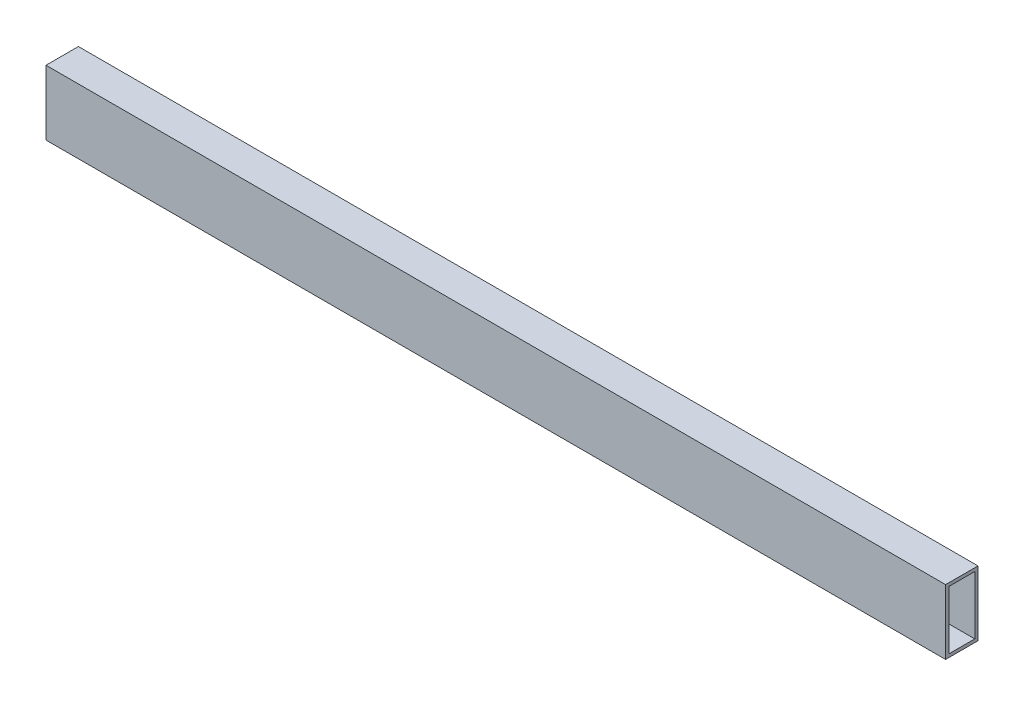
ISO-10303-21;
HEADER;
FILE_DESCRIPTION(('STEP AP214'),'2;1');
FILE_NAME('part.step','',(''),(''),'','','');
FILE_SCHEMA(('AUTOMOTIVE_DESIGN { 1 0 10303 214 1 1 1 1 }'));
ENDSEC;
DATA;
#1=APPLICATION_CONTEXT('core data for automotive mechanical design processes');
#2=APPLICATION_PROTOCOL_DEFINITION('international standard','automotive_design',2000,#1);
#3=PRODUCT_CONTEXT('',#1,'mechanical');
#4=PRODUCT('Part','Part','',(#3));
#5=PRODUCT_RELATED_PRODUCT_CATEGORY('part','',(#4));
#6=PRODUCT_DEFINITION_FORMATION('','',#4);
#7=PRODUCT_DEFINITION_CONTEXT('part definition',#1,'design');
#8=PRODUCT_DEFINITION('design','',#6,#7);
#9=PRODUCT_DEFINITION_SHAPE('','',#8);
#10=(LENGTH_UNIT() NAMED_UNIT(*) SI_UNIT(.MILLI.,.METRE.));
#11=(NAMED_UNIT(*) PLANE_ANGLE_UNIT() SI_UNIT($,.RADIAN.));
#12=(NAMED_UNIT(*) SI_UNIT($,.STERADIAN.) SOLID_ANGLE_UNIT());
#13=UNCERTAINTY_MEASURE_WITH_UNIT(LENGTH_MEASURE(1.E-05),#10,'distance_accuracy_value','');
#14=(GEOMETRIC_REPRESENTATION_CONTEXT(3) GLOBAL_UNCERTAINTY_ASSIGNED_CONTEXT((#13)) GLOBAL_UNIT_ASSIGNED_CONTEXT((#10,
#11,#12)) REPRESENTATION_CONTEXT('',''));
#15=CARTESIAN_POINT('',(0.,0.,0.));
#16=DIRECTION('',(0.,0.,1.));
#17=DIRECTION('',(1.,0.,0.));
#18=AXIS2_PLACEMENT_3D('',#15,#16,#17);
#19=CARTESIAN_POINT('',(704.85,0.,0.));
#20=DIRECTION('',(1.,0.,0.));
#21=DIRECTION('',(0.,0.,-1.));
#22=AXIS2_PLACEMENT_3D('',#19,#20,#21);
#23=PLANE('',#22);
#24=DIRECTION('',(0.,1.,0.));
#25=VECTOR('',#24,1.);
#26=CARTESIAN_POINT('',(704.85,-25.4,-12.7));
#27=LINE('',#26,#25);
#28=CARTESIAN_POINT('',(704.85,-25.4,-12.7));
#29=VERTEX_POINT('',#28);
#30=CARTESIAN_POINT('',(704.85,25.4,-12.7));
#31=VERTEX_POINT('',#30);
#32=EDGE_CURVE('E168',#29,#31,#27,.T.);
#33=ORIENTED_EDGE('',*,*,#32,.T.);
#34=DIRECTION('',(0.,0.,1.));
#35=VECTOR('',#34,1.);
#36=CARTESIAN_POINT('',(704.85,25.4,12.7));
#37=LINE('',#36,#35);
#38=CARTESIAN_POINT('',(704.85,25.4,12.7));
#39=VERTEX_POINT('',#38);
#40=EDGE_CURVE('E171',#31,#39,#37,.T.);
#41=ORIENTED_EDGE('',*,*,#40,.T.);
#42=DIRECTION('',(0.,-1.,0.));
#43=VECTOR('',#42,1.);
#44=CARTESIAN_POINT('',(704.85,-25.4,12.7));
#45=LINE('',#44,#43);
#46=CARTESIAN_POINT('',(704.85,-25.4,12.7));
#47=VERTEX_POINT('',#46);
#48=EDGE_CURVE('E174',#39,#47,#45,.T.);
#49=ORIENTED_EDGE('',*,*,#48,.T.);
#50=DIRECTION('',(0.,0.,-1.));
#51=VECTOR('',#50,1.);
#52=CARTESIAN_POINT('',(704.85,-25.4,12.7));
#53=LINE('',#52,#51);
#54=EDGE_CURVE('E176',#47,#29,#53,.T.);
#55=ORIENTED_EDGE('',*,*,#54,.T.);
#56=EDGE_LOOP('',(#33,#41,#49,#55));
#57=FACE_BOUND('',#56,.T.);
#58=DIRECTION('',(0.,0.,1.));
#59=VECTOR('',#58,1.);
#60=CARTESIAN_POINT('',(704.85,22.86,0.));
#61=LINE('',#60,#59);
#62=CARTESIAN_POINT('',(704.85,22.86,-10.16));
#63=VERTEX_POINT('',#62);
#64=CARTESIAN_POINT('',(704.85,22.86,10.16));
#65=VERTEX_POINT('',#64);
#66=EDGE_CURVE('E140',#63,#65,#61,.T.);
#67=ORIENTED_EDGE('',*,*,#66,.F.);
#68=DIRECTION('',(0.,1.,0.));
#69=VECTOR('',#68,1.);
#70=CARTESIAN_POINT('',(704.85,0.,-10.16));
#71=LINE('',#70,#69);
#72=CARTESIAN_POINT('',(704.85,-22.86,-10.16));
#73=VERTEX_POINT('',#72);
#74=EDGE_CURVE('E132',#73,#63,#71,.T.);
#75=ORIENTED_EDGE('',*,*,#74,.F.);
#76=DIRECTION('',(0.,0.,-1.));
#77=VECTOR('',#76,1.);
#78=CARTESIAN_POINT('',(704.85,-22.86,0.));
#79=LINE('',#78,#77);
#80=CARTESIAN_POINT('',(704.85,-22.86,10.16));
#81=VERTEX_POINT('',#80);
#82=EDGE_CURVE('E154',#81,#73,#79,.T.);
#83=ORIENTED_EDGE('',*,*,#82,.F.);
#84=DIRECTION('',(0.,-1.,0.));
#85=VECTOR('',#84,1.);
#86=CARTESIAN_POINT('',(704.85,0.,10.16));
#87=LINE('',#86,#85);
#88=EDGE_CURVE('E152',#65,#81,#87,.T.);
#89=ORIENTED_EDGE('',*,*,#88,.F.);
#90=EDGE_LOOP('',(#67,#75,#83,#89));
#91=FACE_BOUND('',#90,.T.);
#92=ADVANCED_FACE('F67',(#57,#91),#23,.T.);
#93=CARTESIAN_POINT('',(0.,0.,0.));
#94=DIRECTION('',(1.,0.,0.));
#95=DIRECTION('',(0.,0.,-1.));
#96=AXIS2_PLACEMENT_3D('',#93,#94,#95);
#97=PLANE('',#96);
#98=DIRECTION('',(0.,1.,0.));
#99=VECTOR('',#98,1.);
#100=CARTESIAN_POINT('',(0.,-25.4,-12.7));
#101=LINE('',#100,#99);
#102=CARTESIAN_POINT('',(0.,-25.4,-12.7));
#103=VERTEX_POINT('',#102);
#104=CARTESIAN_POINT('',(0.,25.4,-12.7));
#105=VERTEX_POINT('',#104);
#106=EDGE_CURVE('E148',#103,#105,#101,.T.);
#107=ORIENTED_EDGE('',*,*,#106,.F.);
#108=DIRECTION('',(0.,0.,-1.));
#109=VECTOR('',#108,1.);
#110=CARTESIAN_POINT('',(0.,-25.4,12.7));
#111=LINE('',#110,#109);
#112=CARTESIAN_POINT('',(0.,-25.4,12.7));
#113=VERTEX_POINT('',#112);
#114=EDGE_CURVE('E172',#113,#103,#111,.T.);
#115=ORIENTED_EDGE('',*,*,#114,.F.);
#116=DIRECTION('',(0.,-1.,0.));
#117=VECTOR('',#116,1.);
#118=CARTESIAN_POINT('',(0.,-25.4,12.7));
#119=LINE('',#118,#117);
#120=CARTESIAN_POINT('',(0.,25.4,12.7));
#121=VERTEX_POINT('',#120);
#122=EDGE_CURVE('E183',#121,#113,#119,.T.);
#123=ORIENTED_EDGE('',*,*,#122,.F.);
#124=DIRECTION('',(0.,0.,1.));
#125=VECTOR('',#124,1.);
#126=CARTESIAN_POINT('',(0.,25.4,12.7));
#127=LINE('',#126,#125);
#128=EDGE_CURVE('E181',#105,#121,#127,.T.);
#129=ORIENTED_EDGE('',*,*,#128,.F.);
#130=EDGE_LOOP('',(#107,#115,#123,#129));
#131=FACE_BOUND('',#130,.T.);
#132=DIRECTION('',(0.,1.,0.));
#133=VECTOR('',#132,1.);
#134=CARTESIAN_POINT('',(0.,0.,-10.16));
#135=LINE('',#134,#133);
#136=CARTESIAN_POINT('',(0.,-22.86,-10.16));
#137=VERTEX_POINT('',#136);
#138=CARTESIAN_POINT('',(0.,22.86,-10.16));
#139=VERTEX_POINT('',#138);
#140=EDGE_CURVE('E90',#137,#139,#135,.T.);
#141=ORIENTED_EDGE('',*,*,#140,.T.);
#142=DIRECTION('',(0.,0.,1.));
#143=VECTOR('',#142,1.);
#144=CARTESIAN_POINT('',(0.,22.86,0.));
#145=LINE('',#144,#143);
#146=CARTESIAN_POINT('',(0.,22.86,10.16));
#147=VERTEX_POINT('',#146);
#148=EDGE_CURVE('E147',#139,#147,#145,.T.);
#149=ORIENTED_EDGE('',*,*,#148,.T.);
#150=DIRECTION('',(0.,-1.,0.));
#151=VECTOR('',#150,1.);
#152=CARTESIAN_POINT('',(0.,0.,10.16));
#153=LINE('',#152,#151);
#154=CARTESIAN_POINT('',(0.,-22.86,10.16));
#155=VERTEX_POINT('',#154);
#156=EDGE_CURVE('E160',#147,#155,#153,.T.);
#157=ORIENTED_EDGE('',*,*,#156,.T.);
#158=DIRECTION('',(0.,0.,-1.));
#159=VECTOR('',#158,1.);
#160=CARTESIAN_POINT('',(0.,-22.86,0.));
#161=LINE('',#160,#159);
#162=EDGE_CURVE('E141',#155,#137,#161,.T.);
#163=ORIENTED_EDGE('',*,*,#162,.T.);
#164=EDGE_LOOP('',(#141,#149,#157,#163));
#165=FACE_BOUND('',#164,.T.);
#166=ADVANCED_FACE('F201',(#131,#165),#97,.F.);
#167=CARTESIAN_POINT('',(704.85,-25.4,-12.7));
#168=DIRECTION('',(0.,0.,1.));
#169=DIRECTION('',(1.,0.,0.));
#170=AXIS2_PLACEMENT_3D('',#167,#168,#169);
#171=PLANE('',#170);
#172=ORIENTED_EDGE('',*,*,#106,.T.);
#173=DIRECTION('',(-1.,0.,0.));
#174=VECTOR('',#173,1.);
#175=CARTESIAN_POINT('',(704.85,25.4,-12.7));
#176=LINE('',#175,#174);
#177=EDGE_CURVE('E12',#31,#105,#176,.T.);
#178=ORIENTED_EDGE('',*,*,#177,.F.);
#179=ORIENTED_EDGE('',*,*,#32,.F.);
#180=DIRECTION('',(-1.,0.,0.));
#181=VECTOR('',#180,1.);
#182=CARTESIAN_POINT('',(704.85,-25.4,-12.7));
#183=LINE('',#182,#181);
#184=EDGE_CURVE('E178',#29,#103,#183,.T.);
#185=ORIENTED_EDGE('',*,*,#184,.T.);
#186=EDGE_LOOP('',(#172,#178,#179,#185));
#187=FACE_BOUND('',#186,.T.);
#188=ADVANCED_FACE('F69',(#187),#171,.F.);
#189=CARTESIAN_POINT('',(704.85,25.4,12.7));
#190=DIRECTION('',(0.,-1.,0.));
#191=DIRECTION('',(0.,0.,-1.));
#192=AXIS2_PLACEMENT_3D('',#189,#190,#191);
#193=PLANE('',#192);
#194=ORIENTED_EDGE('',*,*,#128,.T.);
#195=DIRECTION('',(-1.,0.,0.));
#196=VECTOR('',#195,1.);
#197=CARTESIAN_POINT('',(704.85,25.4,12.7));
#198=LINE('',#197,#196);
#199=EDGE_CURVE('E75',#39,#121,#198,.T.);
#200=ORIENTED_EDGE('',*,*,#199,.F.);
#201=ORIENTED_EDGE('',*,*,#40,.F.);
#202=ORIENTED_EDGE('',*,*,#177,.T.);
#203=EDGE_LOOP('',(#194,#200,#201,#202));
#204=FACE_BOUND('',#203,.T.);
#205=ADVANCED_FACE('F211',(#204),#193,.F.);
#206=CARTESIAN_POINT('',(704.85,-25.4,12.7));
#207=DIRECTION('',(0.,0.,-1.));
#208=DIRECTION('',(-1.,0.,0.));
#209=AXIS2_PLACEMENT_3D('',#206,#207,#208);
#210=PLANE('',#209);
#211=ORIENTED_EDGE('',*,*,#122,.T.);
#212=DIRECTION('',(-1.,0.,0.));
#213=VECTOR('',#212,1.);
#214=CARTESIAN_POINT('',(704.85,-25.4,12.7));
#215=LINE('',#214,#213);
#216=EDGE_CURVE('E188',#47,#113,#215,.T.);
#217=ORIENTED_EDGE('',*,*,#216,.F.);
#218=ORIENTED_EDGE('',*,*,#48,.F.);
#219=ORIENTED_EDGE('',*,*,#199,.T.);
#220=EDGE_LOOP('',(#211,#217,#218,#219));
#221=FACE_BOUND('',#220,.T.);
#222=ADVANCED_FACE('F195',(#221),#210,.F.);
#223=CARTESIAN_POINT('',(704.85,-25.4,12.7));
#224=DIRECTION('',(0.,1.,0.));
#225=DIRECTION('',(0.,0.,1.));
#226=AXIS2_PLACEMENT_3D('',#223,#224,#225);
#227=PLANE('',#226);
#228=ORIENTED_EDGE('',*,*,#114,.T.);
#229=ORIENTED_EDGE('',*,*,#184,.F.);
#230=ORIENTED_EDGE('',*,*,#54,.F.);
#231=ORIENTED_EDGE('',*,*,#216,.T.);
#232=EDGE_LOOP('',(#228,#229,#230,#231));
#233=FACE_BOUND('',#232,.T.);
#234=ADVANCED_FACE('F205',(#233),#227,.F.);
#235=CARTESIAN_POINT('',(704.85,0.,-10.16));
#236=DIRECTION('',(0.,0.,1.));
#237=DIRECTION('',(1.,0.,0.));
#238=AXIS2_PLACEMENT_3D('',#235,#236,#237);
#239=PLANE('',#238);
#240=ORIENTED_EDGE('',*,*,#140,.F.);
#241=DIRECTION('',(-1.,0.,0.));
#242=VECTOR('',#241,1.);
#243=CARTESIAN_POINT('',(704.85,-22.86,-10.16));
#244=LINE('',#243,#242);
#245=EDGE_CURVE('E136',#73,#137,#244,.T.);
#246=ORIENTED_EDGE('',*,*,#245,.F.);
#247=ORIENTED_EDGE('',*,*,#74,.T.);
#248=DIRECTION('',(-1.,0.,0.));
#249=VECTOR('',#248,1.);
#250=CARTESIAN_POINT('',(704.85,22.86,-10.16));
#251=LINE('',#250,#249);
#252=EDGE_CURVE('E135',#63,#139,#251,.T.);
#253=ORIENTED_EDGE('',*,*,#252,.T.);
#254=EDGE_LOOP('',(#240,#246,#247,#253));
#255=FACE_BOUND('',#254,.T.);
#256=ADVANCED_FACE('F134',(#255),#239,.T.);
#257=CARTESIAN_POINT('',(704.85,22.86,0.));
#258=DIRECTION('',(0.,-1.,0.));
#259=DIRECTION('',(0.,0.,-1.));
#260=AXIS2_PLACEMENT_3D('',#257,#258,#259);
#261=PLANE('',#260);
#262=ORIENTED_EDGE('',*,*,#148,.F.);
#263=ORIENTED_EDGE('',*,*,#252,.F.);
#264=ORIENTED_EDGE('',*,*,#66,.T.);
#265=DIRECTION('',(-1.,0.,0.));
#266=VECTOR('',#265,1.);
#267=CARTESIAN_POINT('',(704.85,22.86,10.16));
#268=LINE('',#267,#266);
#269=EDGE_CURVE('E149',#65,#147,#268,.T.);
#270=ORIENTED_EDGE('',*,*,#269,.T.);
#271=EDGE_LOOP('',(#262,#263,#264,#270));
#272=FACE_BOUND('',#271,.T.);
#273=ADVANCED_FACE('F144',(#272),#261,.T.);
#274=CARTESIAN_POINT('',(704.85,0.,10.16));
#275=DIRECTION('',(0.,0.,-1.));
#276=DIRECTION('',(-1.,0.,0.));
#277=AXIS2_PLACEMENT_3D('',#274,#275,#276);
#278=PLANE('',#277);
#279=ORIENTED_EDGE('',*,*,#156,.F.);
#280=ORIENTED_EDGE('',*,*,#269,.F.);
#281=ORIENTED_EDGE('',*,*,#88,.T.);
#282=DIRECTION('',(-1.,0.,0.));
#283=VECTOR('',#282,1.);
#284=CARTESIAN_POINT('',(704.85,-22.86,10.16));
#285=LINE('',#284,#283);
#286=EDGE_CURVE('E82',#81,#155,#285,.T.);
#287=ORIENTED_EDGE('',*,*,#286,.T.);
#288=EDGE_LOOP('',(#279,#280,#281,#287));
#289=FACE_BOUND('',#288,.T.);
#290=ADVANCED_FACE('F234',(#289),#278,.T.);
#291=CARTESIAN_POINT('',(704.85,-22.86,0.));
#292=DIRECTION('',(0.,1.,0.));
#293=DIRECTION('',(0.,0.,1.));
#294=AXIS2_PLACEMENT_3D('',#291,#292,#293);
#295=PLANE('',#294);
#296=ORIENTED_EDGE('',*,*,#162,.F.);
#297=ORIENTED_EDGE('',*,*,#286,.F.);
#298=ORIENTED_EDGE('',*,*,#82,.T.);
#299=ORIENTED_EDGE('',*,*,#245,.T.);
#300=EDGE_LOOP('',(#296,#297,#298,#299));
#301=FACE_BOUND('',#300,.T.);
#302=ADVANCED_FACE('F238',(#301),#295,.T.);
#303=CLOSED_SHELL('',(#92,#166,#188,#205,#222,#234,#256,#273,#290,#302));
#304=MANIFOLD_SOLID_BREP('B2',#303);
#305=ADVANCED_BREP_SHAPE_REPRESENTATION('',(#18,#304),#14);
#306=SHAPE_DEFINITION_REPRESENTATION(#9,#305);
ENDSEC;
END-ISO-10303-21;
